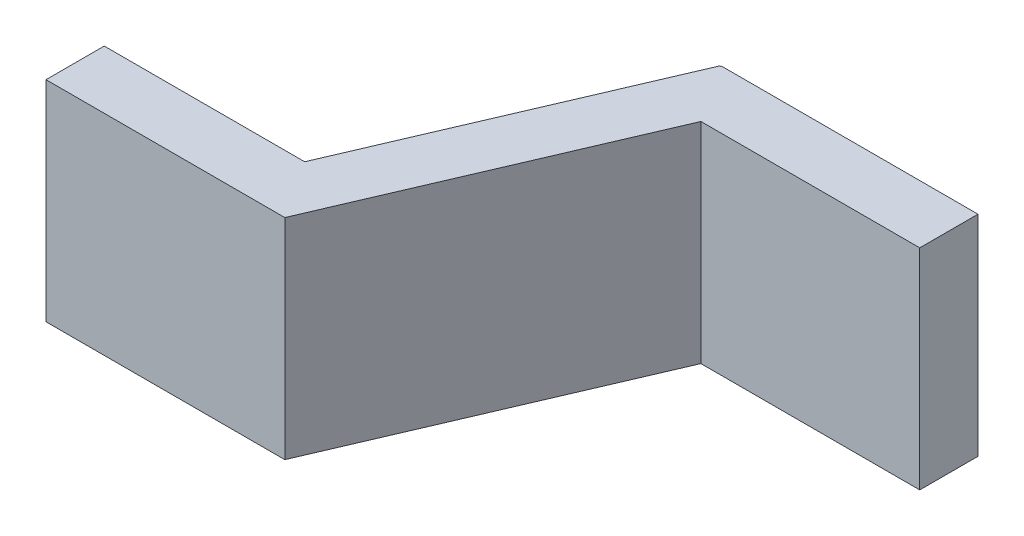
ISO-10303-21;
HEADER;
FILE_DESCRIPTION(('STEP AP214'),'2;1');
FILE_NAME('part.step','',(''),(''),'','','');
FILE_SCHEMA(('AUTOMOTIVE_DESIGN { 1 0 10303 214 1 1 1 1 }'));
ENDSEC;
DATA;
#1=APPLICATION_CONTEXT('core data for automotive mechanical design processes');
#2=APPLICATION_PROTOCOL_DEFINITION('international standard','automotive_design',2000,#1);
#3=PRODUCT_CONTEXT('',#1,'mechanical');
#4=PRODUCT('Part','Part','',(#3));
#5=PRODUCT_RELATED_PRODUCT_CATEGORY('part','',(#4));
#6=PRODUCT_DEFINITION_FORMATION('','',#4);
#7=PRODUCT_DEFINITION_CONTEXT('part definition',#1,'design');
#8=PRODUCT_DEFINITION('design','',#6,#7);
#9=PRODUCT_DEFINITION_SHAPE('','',#8);
#10=(LENGTH_UNIT() NAMED_UNIT(*) SI_UNIT(.MILLI.,.METRE.));
#11=(NAMED_UNIT(*) PLANE_ANGLE_UNIT() SI_UNIT($,.RADIAN.));
#12=(NAMED_UNIT(*) SI_UNIT($,.STERADIAN.) SOLID_ANGLE_UNIT());
#13=UNCERTAINTY_MEASURE_WITH_UNIT(LENGTH_MEASURE(1.E-05),#10,'distance_accuracy_value','');
#14=(GEOMETRIC_REPRESENTATION_CONTEXT(3) GLOBAL_UNCERTAINTY_ASSIGNED_CONTEXT((#13)) GLOBAL_UNIT_ASSIGNED_CONTEXT((#10,
#11,#12)) REPRESENTATION_CONTEXT('',''));
#15=CARTESIAN_POINT('',(0.,0.,0.));
#16=DIRECTION('',(0.,0.,1.));
#17=DIRECTION('',(1.,0.,0.));
#18=AXIS2_PLACEMENT_3D('',#15,#16,#17);
#19=CARTESIAN_POINT('',(11.558086453539,2.62,0.0006058345056003));
#20=DIRECTION('',(-0.919135450912914,0.,-0.393941649073963));
#21=DIRECTION('',(-0.393941649073963,0.,0.919135450912914));
#22=AXIS2_PLACEMENT_3D('',#19,#20,#21);
#23=PLANE('',#22);
#24=DIRECTION('',(0.,1.,0.));
#25=VECTOR('',#24,1.);
#26=CARTESIAN_POINT('',(11.344046008361,2.62,0.5));
#27=LINE('',#26,#25);
#28=CARTESIAN_POINT('',(11.344046008361,2.62,0.5));
#29=VERTEX_POINT('',#28);
#30=CARTESIAN_POINT('',(11.344046008361,2.980000014305,0.5));
#31=VERTEX_POINT('',#30);
#32=EDGE_CURVE('E94',#29,#31,#27,.T.);
#33=ORIENTED_EDGE('',*,*,#32,.T.);
#34=DIRECTION('',(-0.393941649073123,0.,0.919135450913275));
#35=VECTOR('',#34,1.);
#36=CARTESIAN_POINT('',(11.558086453539,2.980000014305,0.000605834505600302));
#37=LINE('',#36,#35);
#38=CARTESIAN_POINT('',(11.558086453539,2.980000014305,0.000605834505577237));
#39=VERTEX_POINT('',#38);
#40=EDGE_CURVE('E121',#39,#31,#37,.T.);
#41=ORIENTED_EDGE('',*,*,#40,.F.);
#42=DIRECTION('',(0.,1.,0.));
#43=VECTOR('',#42,1.);
#44=CARTESIAN_POINT('',(11.558086453539,2.62,0.000605834505554305));
#45=LINE('',#44,#43);
#46=CARTESIAN_POINT('',(11.558086453539,2.62,0.000605834505584969));
#47=VERTEX_POINT('',#46);
#48=EDGE_CURVE('E110',#39,#47,#45,.F.);
#49=ORIENTED_EDGE('',*,*,#48,.T.);
#50=DIRECTION('',(-0.393941649073123,0.,0.919135450913275));
#51=VECTOR('',#50,1.);
#52=CARTESIAN_POINT('',(11.558086453539,2.62,0.000605834505600302));
#53=LINE('',#52,#51);
#54=EDGE_CURVE('E100',#47,#29,#53,.T.);
#55=ORIENTED_EDGE('',*,*,#54,.T.);
#56=EDGE_LOOP('',(#33,#41,#49,#55));
#57=FACE_BOUND('',#56,.T.);
#58=ADVANCED_FACE('F17',(#57),#23,.T.);
#59=CARTESIAN_POINT('',(11.,2.62,0.5));
#60=DIRECTION('',(0.,0.,1.));
#61=DIRECTION('',(1.,0.,0.));
#62=AXIS2_PLACEMENT_3D('',#59,#60,#61);
#63=PLANE('',#62);
#64=DIRECTION('',(1.,0.,0.));
#65=VECTOR('',#64,1.);
#66=CARTESIAN_POINT('',(11.65,2.980000014305,0.5));
#67=LINE('',#66,#65);
#68=CARTESIAN_POINT('',(11.,2.980000014305,0.5));
#69=VERTEX_POINT('',#68);
#70=EDGE_CURVE('E79',#31,#69,#67,.F.);
#71=ORIENTED_EDGE('',*,*,#70,.F.);
#72=ORIENTED_EDGE('',*,*,#32,.F.);
#73=DIRECTION('',(1.,0.,0.));
#74=VECTOR('',#73,1.);
#75=CARTESIAN_POINT('',(11.65,2.62,0.5));
#76=LINE('',#75,#74);
#77=CARTESIAN_POINT('',(11.,2.62,0.5));
#78=VERTEX_POINT('',#77);
#79=EDGE_CURVE('E169',#29,#78,#76,.F.);
#80=ORIENTED_EDGE('',*,*,#79,.T.);
#81=DIRECTION('',(0.,1.,0.));
#82=VECTOR('',#81,1.);
#83=CARTESIAN_POINT('',(11.,2.62,0.5));
#84=LINE('',#83,#82);
#85=EDGE_CURVE('E87',#78,#69,#84,.T.);
#86=ORIENTED_EDGE('',*,*,#85,.T.);
#87=EDGE_LOOP('',(#71,#72,#80,#86));
#88=FACE_BOUND('',#87,.T.);
#89=ADVANCED_FACE('F198',(#88),#63,.F.);
#90=CARTESIAN_POINT('',(11.,2.62,0.5));
#91=DIRECTION('',(1.,0.,0.));
#92=DIRECTION('',(0.,0.,-1.));
#93=AXIS2_PLACEMENT_3D('',#90,#91,#92);
#94=PLANE('',#93);
#95=ORIENTED_EDGE('',*,*,#85,.F.);
#96=DIRECTION('',(0.,0.,1.));
#97=VECTOR('',#96,1.);
#98=CARTESIAN_POINT('',(11.,2.62,0.04));
#99=LINE('',#98,#97);
#100=CARTESIAN_POINT('',(11.,2.62,0.60000000149));
#101=VERTEX_POINT('',#100);
#102=EDGE_CURVE('E153',#78,#101,#99,.T.);
#103=ORIENTED_EDGE('',*,*,#102,.T.);
#104=DIRECTION('',(0.,1.,0.));
#105=VECTOR('',#104,1.);
#106=CARTESIAN_POINT('',(11.,2.62,0.60000000149));
#107=LINE('',#106,#105);
#108=CARTESIAN_POINT('',(11.,2.980000014305,0.60000000149));
#109=VERTEX_POINT('',#108);
#110=EDGE_CURVE('E117',#109,#101,#107,.F.);
#111=ORIENTED_EDGE('',*,*,#110,.F.);
#112=DIRECTION('',(0.,0.,1.));
#113=VECTOR('',#112,1.);
#114=CARTESIAN_POINT('',(11.,2.980000014305,0.04));
#115=LINE('',#114,#113);
#116=EDGE_CURVE('E71',#69,#109,#115,.T.);
#117=ORIENTED_EDGE('',*,*,#116,.F.);
#118=EDGE_LOOP('',(#95,#103,#111,#117));
#119=FACE_BOUND('',#118,.T.);
#120=ADVANCED_FACE('F202',(#119),#94,.F.);
#121=CARTESIAN_POINT('',(11.999999997616,2.62,0.));
#122=DIRECTION('',(1.,0.,0.));
#123=DIRECTION('',(0.,0.,-1.));
#124=AXIS2_PLACEMENT_3D('',#121,#122,#123);
#125=PLANE('',#124);
#126=DIRECTION('',(0.,0.,1.));
#127=VECTOR('',#126,1.);
#128=CARTESIAN_POINT('',(11.999999997616,2.62,0.04));
#129=LINE('',#128,#127);
#130=CARTESIAN_POINT('',(11.999999997616,2.62,0.10000000149));
#131=VERTEX_POINT('',#130);
#132=CARTESIAN_POINT('',(11.999999997616,2.62,0.));
#133=VERTEX_POINT('',#132);
#134=EDGE_CURVE('E179',#131,#133,#129,.F.);
#135=ORIENTED_EDGE('',*,*,#134,.T.);
#136=DIRECTION('',(0.,1.,0.));
#137=VECTOR('',#136,1.);
#138=CARTESIAN_POINT('',(11.999999997616,2.62,0.));
#139=LINE('',#138,#137);
#140=CARTESIAN_POINT('',(11.999999997616,2.980000014305,0.));
#141=VERTEX_POINT('',#140);
#142=EDGE_CURVE('E174',#133,#141,#139,.T.);
#143=ORIENTED_EDGE('',*,*,#142,.T.);
#144=DIRECTION('',(0.,0.,1.));
#145=VECTOR('',#144,1.);
#146=CARTESIAN_POINT('',(11.999999997616,2.980000014305,0.04));
#147=LINE('',#146,#145);
#148=CARTESIAN_POINT('',(11.999999997616,2.980000014305,0.10000000149));
#149=VERTEX_POINT('',#148);
#150=EDGE_CURVE('E155',#149,#141,#147,.F.);
#151=ORIENTED_EDGE('',*,*,#150,.F.);
#152=DIRECTION('',(0.,1.,0.));
#153=VECTOR('',#152,1.);
#154=CARTESIAN_POINT('',(11.999999997616,2.62,0.10000000149));
#155=LINE('',#154,#153);
#156=EDGE_CURVE('E125',#131,#149,#155,.T.);
#157=ORIENTED_EDGE('',*,*,#156,.F.);
#158=EDGE_LOOP('',(#135,#143,#151,#157));
#159=FACE_BOUND('',#158,.T.);
#160=ADVANCED_FACE('F228',(#159),#125,.T.);
#161=CARTESIAN_POINT('',(11.56,2.62,0.));
#162=DIRECTION('',(0.,0.,1.));
#163=DIRECTION('',(1.,0.,0.));
#164=AXIS2_PLACEMENT_3D('',#161,#162,#163);
#165=PLANE('',#164);
#166=DIRECTION('',(1.,0.,0.));
#167=VECTOR('',#166,1.);
#168=CARTESIAN_POINT('',(11.65,2.62,0.));
#169=LINE('',#168,#167);
#170=CARTESIAN_POINT('',(11.56,2.62,0.));
#171=VERTEX_POINT('',#170);
#172=EDGE_CURVE('E150',#133,#171,#169,.F.);
#173=ORIENTED_EDGE('',*,*,#172,.T.);
#174=DIRECTION('',(0.,1.,0.));
#175=VECTOR('',#174,1.);
#176=CARTESIAN_POINT('',(11.56,2.62,0.));
#177=LINE('',#176,#175);
#178=CARTESIAN_POINT('',(11.56,2.980000014305,0.));
#179=VERTEX_POINT('',#178);
#180=EDGE_CURVE('E164',#171,#179,#177,.T.);
#181=ORIENTED_EDGE('',*,*,#180,.T.);
#182=DIRECTION('',(1.,0.,0.));
#183=VECTOR('',#182,1.);
#184=CARTESIAN_POINT('',(11.65,2.980000014305,0.));
#185=LINE('',#184,#183);
#186=EDGE_CURVE('E154',#141,#179,#185,.F.);
#187=ORIENTED_EDGE('',*,*,#186,.F.);
#188=ORIENTED_EDGE('',*,*,#142,.F.);
#189=EDGE_LOOP('',(#173,#181,#187,#188));
#190=FACE_BOUND('',#189,.T.);
#191=ADVANCED_FACE('F232',(#190),#165,.F.);
#192=CARTESIAN_POINT('',(11.56,2.62,0.));
#193=DIRECTION('',(1.,0.,0.));
#194=DIRECTION('',(0.,0.,-1.));
#195=AXIS2_PLACEMENT_3D('',#192,#193,#194);
#196=PLANE('',#195);
#197=DIRECTION('',(0.,1.,0.));
#198=VECTOR('',#197,1.);
#199=CARTESIAN_POINT('',(11.56,2.62,0.00142598092431268));
#200=LINE('',#199,#198);
#201=CARTESIAN_POINT('',(11.56,2.62,0.00142598092431734));
#202=VERTEX_POINT('',#201);
#203=CARTESIAN_POINT('',(11.56,2.980000014305,0.00142598092431734));
#204=VERTEX_POINT('',#203);
#205=EDGE_CURVE('E118',#202,#204,#200,.T.);
#206=ORIENTED_EDGE('',*,*,#205,.T.);
#207=DIRECTION('',(0.,0.,1.));
#208=VECTOR('',#207,1.);
#209=CARTESIAN_POINT('',(11.56,2.980000014305,0.04));
#210=LINE('',#209,#208);
#211=EDGE_CURVE('E123',#179,#204,#210,.T.);
#212=ORIENTED_EDGE('',*,*,#211,.F.);
#213=ORIENTED_EDGE('',*,*,#180,.F.);
#214=DIRECTION('',(0.,0.,-1.));
#215=VECTOR('',#214,1.);
#216=CARTESIAN_POINT('',(11.56,2.62,0.));
#217=LINE('',#216,#215);
#218=EDGE_CURVE('E147',#171,#202,#217,.F.);
#219=ORIENTED_EDGE('',*,*,#218,.T.);
#220=EDGE_LOOP('',(#206,#212,#213,#219));
#221=FACE_BOUND('',#220,.T.);
#222=ADVANCED_FACE('F234',(#221),#196,.F.);
#223=CARTESIAN_POINT('',(11.65,2.62,0.04));
#224=DIRECTION('',(-0.393941649073963,0.,0.919135450912914));
#225=DIRECTION('',(0.919135450912914,0.,0.393941649073963));
#226=AXIS2_PLACEMENT_3D('',#223,#224,#225);
#227=PLANE('',#226);
#228=DIRECTION('',(-0.919135450920459,0.,-0.393941649056361));
#229=VECTOR('',#228,1.);
#230=CARTESIAN_POINT('',(11.56,2.980000014305,0.001425980924322));
#231=LINE('',#230,#229);
#232=EDGE_CURVE('E113',#204,#39,#231,.T.);
#233=ORIENTED_EDGE('',*,*,#232,.F.);
#234=ORIENTED_EDGE('',*,*,#205,.F.);
#235=DIRECTION('',(-0.919135450920459,0.,-0.393941649056361));
#236=VECTOR('',#235,1.);
#237=CARTESIAN_POINT('',(11.56,2.62,0.001425980924322));
#238=LINE('',#237,#236);
#239=EDGE_CURVE('E114',#202,#47,#238,.T.);
#240=ORIENTED_EDGE('',*,*,#239,.T.);
#241=ORIENTED_EDGE('',*,*,#48,.F.);
#242=EDGE_LOOP('',(#233,#234,#240,#241));
#243=FACE_BOUND('',#242,.T.);
#244=ADVANCED_FACE('F112',(#243),#227,.F.);
#245=CARTESIAN_POINT('',(11.,2.62,0.60000000149));
#246=DIRECTION('',(0.,0.,1.));
#247=DIRECTION('',(1.,0.,0.));
#248=AXIS2_PLACEMENT_3D('',#245,#246,#247);
#249=PLANE('',#248);
#250=DIRECTION('',(0.,1.,0.));
#251=VECTOR('',#250,1.);
#252=CARTESIAN_POINT('',(11.4099838806682,2.62,0.60000000149));
#253=LINE('',#252,#251);
#254=CARTESIAN_POINT('',(11.4099838806682,2.62,0.60000000149));
#255=VERTEX_POINT('',#254);
#256=CARTESIAN_POINT('',(11.4099838806682,2.980000014305,0.60000000149));
#257=VERTEX_POINT('',#256);
#258=EDGE_CURVE('E144',#255,#257,#253,.T.);
#259=ORIENTED_EDGE('',*,*,#258,.T.);
#260=DIRECTION('',(1.,0.,0.));
#261=VECTOR('',#260,1.);
#262=CARTESIAN_POINT('',(11.65,2.980000014305,0.60000000149));
#263=LINE('',#262,#261);
#264=EDGE_CURVE('E20',#109,#257,#263,.T.);
#265=ORIENTED_EDGE('',*,*,#264,.F.);
#266=ORIENTED_EDGE('',*,*,#110,.T.);
#267=DIRECTION('',(1.,0.,0.));
#268=VECTOR('',#267,1.);
#269=CARTESIAN_POINT('',(11.,2.62,0.60000000149));
#270=LINE('',#269,#268);
#271=EDGE_CURVE('E151',#101,#255,#270,.T.);
#272=ORIENTED_EDGE('',*,*,#271,.T.);
#273=EDGE_LOOP('',(#259,#265,#266,#272));
#274=FACE_BOUND('',#273,.T.);
#275=ADVANCED_FACE('F205',(#274),#249,.T.);
#276=CARTESIAN_POINT('',(11.65,2.980000014305,0.04));
#277=DIRECTION('',(0.,1.,0.));
#278=DIRECTION('',(0.,0.,1.));
#279=AXIS2_PLACEMENT_3D('',#276,#277,#278);
#280=PLANE('',#279);
#281=ORIENTED_EDGE('',*,*,#211,.T.);
#282=ORIENTED_EDGE('',*,*,#232,.T.);
#283=ORIENTED_EDGE('',*,*,#40,.T.);
#284=ORIENTED_EDGE('',*,*,#70,.T.);
#285=ORIENTED_EDGE('',*,*,#116,.T.);
#286=ORIENTED_EDGE('',*,*,#264,.T.);
#287=DIRECTION('',(-0.393941649073964,0.,0.919135450912914));
#288=VECTOR('',#287,1.);
#289=CARTESIAN_POINT('',(11.6242839866442,2.980000014305,0.100000001490094));
#290=LINE('',#289,#288);
#291=CARTESIAN_POINT('',(11.6242839866442,2.980000014305,0.100000001490047));
#292=VERTEX_POINT('',#291);
#293=EDGE_CURVE('E141',#257,#292,#290,.F.);
#294=ORIENTED_EDGE('',*,*,#293,.T.);
#295=DIRECTION('',(1.,0.,0.));
#296=VECTOR('',#295,1.);
#297=CARTESIAN_POINT('',(11.56,2.980000014305,0.10000000149));
#298=LINE('',#297,#296);
#299=EDGE_CURVE('E170',#149,#292,#298,.F.);
#300=ORIENTED_EDGE('',*,*,#299,.F.);
#301=ORIENTED_EDGE('',*,*,#150,.T.);
#302=ORIENTED_EDGE('',*,*,#186,.T.);
#303=EDGE_LOOP('',(#281,#282,#283,#284,#285,#286,#294,#300,#301,#302));
#304=FACE_BOUND('',#303,.T.);
#305=ADVANCED_FACE('F120',(#304),#280,.T.);
#306=CARTESIAN_POINT('',(11.56,2.62,0.10000000149));
#307=DIRECTION('',(0.,0.,1.));
#308=DIRECTION('',(1.,0.,0.));
#309=AXIS2_PLACEMENT_3D('',#306,#307,#308);
#310=PLANE('',#309);
#311=ORIENTED_EDGE('',*,*,#299,.T.);
#312=DIRECTION('',(0.,1.,0.));
#313=VECTOR('',#312,1.);
#314=CARTESIAN_POINT('',(11.6242839866442,2.62,0.100000001490094));
#315=LINE('',#314,#313);
#316=CARTESIAN_POINT('',(11.6242839866442,2.62,0.100000001490047));
#317=VERTEX_POINT('',#316);
#318=EDGE_CURVE('E26',#292,#317,#315,.F.);
#319=ORIENTED_EDGE('',*,*,#318,.T.);
#320=DIRECTION('',(1.,0.,0.));
#321=VECTOR('',#320,1.);
#322=CARTESIAN_POINT('',(11.65,2.62,0.10000000149));
#323=LINE('',#322,#321);
#324=EDGE_CURVE('E34',#317,#131,#323,.T.);
#325=ORIENTED_EDGE('',*,*,#324,.T.);
#326=ORIENTED_EDGE('',*,*,#156,.T.);
#327=EDGE_LOOP('',(#311,#319,#325,#326));
#328=FACE_BOUND('',#327,.T.);
#329=ADVANCED_FACE('F223',(#328),#310,.T.);
#330=CARTESIAN_POINT('',(11.65,2.62,0.04));
#331=DIRECTION('',(0.,1.,0.));
#332=DIRECTION('',(0.,0.,1.));
#333=AXIS2_PLACEMENT_3D('',#330,#331,#332);
#334=PLANE('',#333);
#335=ORIENTED_EDGE('',*,*,#218,.F.);
#336=ORIENTED_EDGE('',*,*,#172,.F.);
#337=ORIENTED_EDGE('',*,*,#134,.F.);
#338=ORIENTED_EDGE('',*,*,#324,.F.);
#339=DIRECTION('',(0.393941649073964,0.,-0.919135450912914));
#340=VECTOR('',#339,1.);
#341=CARTESIAN_POINT('',(11.4098164411035,2.62,0.600390667570103));
#342=LINE('',#341,#340);
#343=EDGE_CURVE('E11',#317,#255,#342,.F.);
#344=ORIENTED_EDGE('',*,*,#343,.T.);
#345=ORIENTED_EDGE('',*,*,#271,.F.);
#346=ORIENTED_EDGE('',*,*,#102,.F.);
#347=ORIENTED_EDGE('',*,*,#79,.F.);
#348=ORIENTED_EDGE('',*,*,#54,.F.);
#349=ORIENTED_EDGE('',*,*,#239,.F.);
#350=EDGE_LOOP('',(#335,#336,#337,#338,#344,#345,#346,#347,#348,#349));
#351=FACE_BOUND('',#350,.T.);
#352=ADVANCED_FACE('F200',(#351),#334,.F.);
#353=CARTESIAN_POINT('',(11.65,2.62,0.04));
#354=DIRECTION('',(-0.919135450912914,0.,-0.393941649073963));
#355=DIRECTION('',(-0.393941649073963,0.,0.919135450912914));
#356=AXIS2_PLACEMENT_3D('',#353,#354,#355);
#357=PLANE('',#356);
#358=ORIENTED_EDGE('',*,*,#318,.F.);
#359=ORIENTED_EDGE('',*,*,#293,.F.);
#360=ORIENTED_EDGE('',*,*,#258,.F.);
#361=ORIENTED_EDGE('',*,*,#343,.F.);
#362=EDGE_LOOP('',(#358,#359,#360,#361));
#363=FACE_BOUND('',#362,.T.);
#364=ADVANCED_FACE('F210',(#363),#357,.F.);
#365=CLOSED_SHELL('',(#58,#89,#120,#160,#191,#222,#244,#275,#305,#329,#352,#364));
#366=MANIFOLD_SOLID_BREP('B1',#365);
#367=ADVANCED_BREP_SHAPE_REPRESENTATION('',(#18,#366),#14);
#368=SHAPE_DEFINITION_REPRESENTATION(#9,#367);
ENDSEC;
END-ISO-10303-21;
